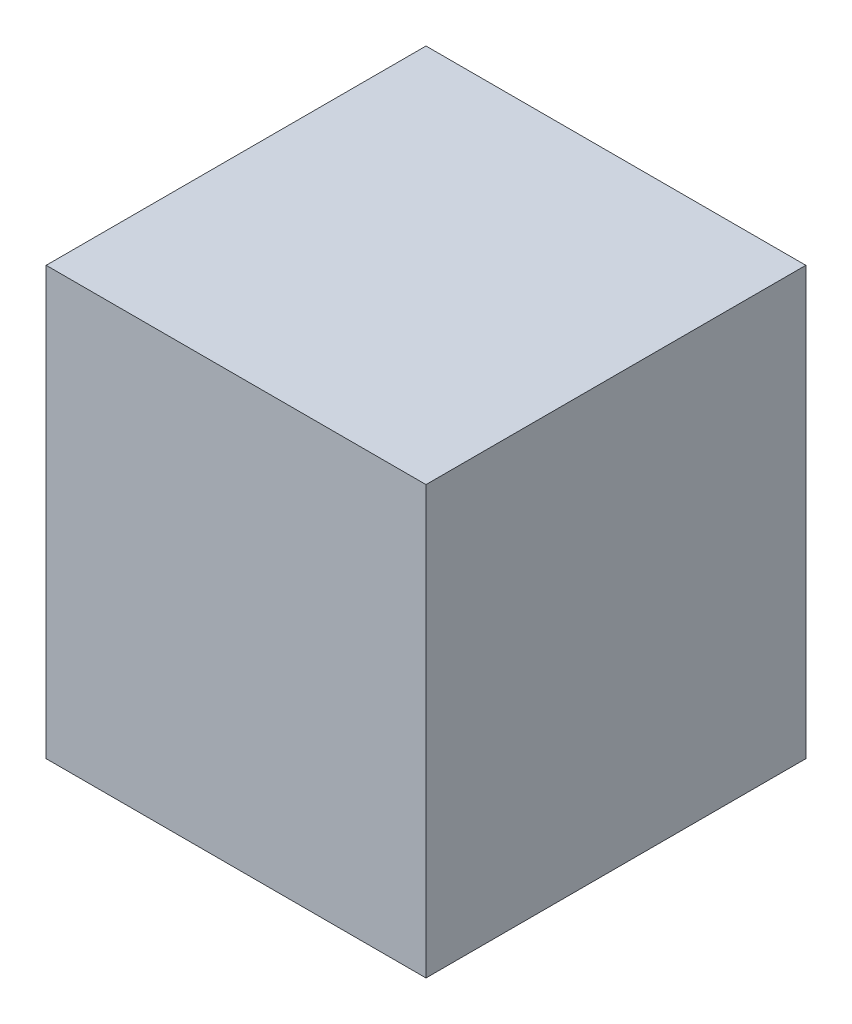
ISO-10303-21;
HEADER;
FILE_DESCRIPTION(('STEP AP214'),'2;1');
FILE_NAME('part.step','',(''),(''),'','','');
FILE_SCHEMA(('AUTOMOTIVE_DESIGN { 1 0 10303 214 1 1 1 1 }'));
ENDSEC;
DATA;
#1=APPLICATION_CONTEXT('core data for automotive mechanical design processes');
#2=APPLICATION_PROTOCOL_DEFINITION('international standard','automotive_design',2000,#1);
#3=PRODUCT_CONTEXT('',#1,'mechanical');
#4=PRODUCT('Part','Part','',(#3));
#5=PRODUCT_RELATED_PRODUCT_CATEGORY('part','',(#4));
#6=PRODUCT_DEFINITION_FORMATION('','',#4);
#7=PRODUCT_DEFINITION_CONTEXT('part definition',#1,'design');
#8=PRODUCT_DEFINITION('design','',#6,#7);
#9=PRODUCT_DEFINITION_SHAPE('','',#8);
#10=(LENGTH_UNIT() NAMED_UNIT(*) SI_UNIT(.MILLI.,.METRE.));
#11=(NAMED_UNIT(*) PLANE_ANGLE_UNIT() SI_UNIT($,.RADIAN.));
#12=(NAMED_UNIT(*) SI_UNIT($,.STERADIAN.) SOLID_ANGLE_UNIT());
#13=UNCERTAINTY_MEASURE_WITH_UNIT(LENGTH_MEASURE(1.E-05),#10,'distance_accuracy_value','');
#14=(GEOMETRIC_REPRESENTATION_CONTEXT(3) GLOBAL_UNCERTAINTY_ASSIGNED_CONTEXT((#13)) GLOBAL_UNIT_ASSIGNED_CONTEXT((#10,
#11,#12)) REPRESENTATION_CONTEXT('',''));
#15=CARTESIAN_POINT('',(0.,0.,0.));
#16=DIRECTION('',(0.,0.,1.));
#17=DIRECTION('',(1.,0.,0.));
#18=AXIS2_PLACEMENT_3D('',#15,#16,#17);
#19=CARTESIAN_POINT('',(-0.3999992,-0.4499991,0.80000094));
#20=DIRECTION('',(0.,0.,-1.));
#21=DIRECTION('',(-1.,0.,0.));
#22=AXIS2_PLACEMENT_3D('',#19,#20,#21);
#23=PLANE('',#22);
#24=DIRECTION('',(0.,1.,0.));
#25=VECTOR('',#24,1.);
#26=CARTESIAN_POINT('',(0.40000174,-0.4499991,0.80000094));
#27=LINE('',#26,#25);
#28=CARTESIAN_POINT('',(0.40000174,-0.4499991,0.80000094));
#29=VERTEX_POINT('',#28);
#30=CARTESIAN_POINT('',(0.40000174,0.45000164,0.80000094));
#31=VERTEX_POINT('',#30);
#32=EDGE_CURVE('E55',#29,#31,#27,.T.);
#33=ORIENTED_EDGE('',*,*,#32,.T.);
#34=DIRECTION('',(1.,0.,0.));
#35=VECTOR('',#34,1.);
#36=CARTESIAN_POINT('',(0.40000174,0.45000164,0.80000094));
#37=LINE('',#36,#35);
#38=CARTESIAN_POINT('',(-0.3999992,0.45000164,0.80000094));
#39=VERTEX_POINT('',#38);
#40=EDGE_CURVE('E57',#31,#39,#37,.F.);
#41=ORIENTED_EDGE('',*,*,#40,.T.);
#42=DIRECTION('',(0.,1.,0.));
#43=VECTOR('',#42,1.);
#44=CARTESIAN_POINT('',(-0.3999992,0.45000164,0.80000094));
#45=LINE('',#44,#43);
#46=CARTESIAN_POINT('',(-0.3999992,-0.4499991,0.80000094));
#47=VERTEX_POINT('',#46);
#48=EDGE_CURVE('E20',#39,#47,#45,.F.);
#49=ORIENTED_EDGE('',*,*,#48,.T.);
#50=DIRECTION('',(1.,0.,0.));
#51=VECTOR('',#50,1.);
#52=CARTESIAN_POINT('',(-0.3999992,-0.4499991,0.80000094));
#53=LINE('',#52,#51);
#54=EDGE_CURVE('E80',#47,#29,#53,.T.);
#55=ORIENTED_EDGE('',*,*,#54,.T.);
#56=EDGE_LOOP('',(#33,#41,#49,#55));
#57=FACE_BOUND('',#56,.T.);
#58=ADVANCED_FACE('F17',(#57),#23,.F.);
#59=CARTESIAN_POINT('',(-0.3999992,0.45000164,0.));
#60=DIRECTION('',(1.,0.,0.));
#61=DIRECTION('',(0.,0.,-1.));
#62=AXIS2_PLACEMENT_3D('',#59,#60,#61);
#63=PLANE('',#62);
#64=DIRECTION('',(0.,0.,1.));
#65=VECTOR('',#64,1.);
#66=CARTESIAN_POINT('',(-0.3999992,-0.4499991,0.));
#67=LINE('',#66,#65);
#68=CARTESIAN_POINT('',(-0.3999992,-0.4499991,0.));
#69=VERTEX_POINT('',#68);
#70=EDGE_CURVE('E68',#69,#47,#67,.T.);
#71=ORIENTED_EDGE('',*,*,#70,.T.);
#72=ORIENTED_EDGE('',*,*,#48,.F.);
#73=DIRECTION('',(0.,0.,-1.));
#74=VECTOR('',#73,1.);
#75=CARTESIAN_POINT('',(-0.3999992,0.45000164,0.));
#76=LINE('',#75,#74);
#77=CARTESIAN_POINT('',(-0.3999992,0.45000164,0.));
#78=VERTEX_POINT('',#77);
#79=EDGE_CURVE('E63',#39,#78,#76,.T.);
#80=ORIENTED_EDGE('',*,*,#79,.T.);
#81=DIRECTION('',(0.,1.,0.));
#82=VECTOR('',#81,1.);
#83=CARTESIAN_POINT('',(-0.3999992,-0.4499991,0.));
#84=LINE('',#83,#82);
#85=EDGE_CURVE('E83',#69,#78,#84,.T.);
#86=ORIENTED_EDGE('',*,*,#85,.F.);
#87=EDGE_LOOP('',(#71,#72,#80,#86));
#88=FACE_BOUND('',#87,.T.);
#89=ADVANCED_FACE('F65',(#88),#63,.F.);
#90=CARTESIAN_POINT('',(0.40000174,0.45000164,0.));
#91=DIRECTION('',(0.,-1.,0.));
#92=DIRECTION('',(0.,0.,-1.));
#93=AXIS2_PLACEMENT_3D('',#90,#91,#92);
#94=PLANE('',#93);
#95=ORIENTED_EDGE('',*,*,#79,.F.);
#96=ORIENTED_EDGE('',*,*,#40,.F.);
#97=DIRECTION('',(0.,0.,1.));
#98=VECTOR('',#97,1.);
#99=CARTESIAN_POINT('',(0.40000174,0.45000164,0.));
#100=LINE('',#99,#98);
#101=CARTESIAN_POINT('',(0.40000174,0.45000164,0.));
#102=VERTEX_POINT('',#101);
#103=EDGE_CURVE('E75',#31,#102,#100,.F.);
#104=ORIENTED_EDGE('',*,*,#103,.T.);
#105=DIRECTION('',(-1.,0.,0.));
#106=VECTOR('',#105,1.);
#107=CARTESIAN_POINT('',(-0.3999992,0.45000164,0.));
#108=LINE('',#107,#106);
#109=EDGE_CURVE('E72',#78,#102,#108,.F.);
#110=ORIENTED_EDGE('',*,*,#109,.F.);
#111=EDGE_LOOP('',(#95,#96,#104,#110));
#112=FACE_BOUND('',#111,.T.);
#113=ADVANCED_FACE('F70',(#112),#94,.F.);
#114=CARTESIAN_POINT('',(0.40000174,-0.4499991,0.));
#115=DIRECTION('',(-1.,0.,0.));
#116=DIRECTION('',(0.,0.,1.));
#117=AXIS2_PLACEMENT_3D('',#114,#115,#116);
#118=PLANE('',#117);
#119=ORIENTED_EDGE('',*,*,#103,.F.);
#120=ORIENTED_EDGE('',*,*,#32,.F.);
#121=DIRECTION('',(0.,0.,1.));
#122=VECTOR('',#121,1.);
#123=CARTESIAN_POINT('',(0.40000174,-0.4499991,0.));
#124=LINE('',#123,#122);
#125=CARTESIAN_POINT('',(0.40000174,-0.4499991,0.));
#126=VERTEX_POINT('',#125);
#127=EDGE_CURVE('E35',#29,#126,#124,.F.);
#128=ORIENTED_EDGE('',*,*,#127,.T.);
#129=DIRECTION('',(0.,1.,0.));
#130=VECTOR('',#129,1.);
#131=CARTESIAN_POINT('',(0.40000174,-0.4499991,0.));
#132=LINE('',#131,#130);
#133=EDGE_CURVE('E26',#102,#126,#132,.F.);
#134=ORIENTED_EDGE('',*,*,#133,.F.);
#135=EDGE_LOOP('',(#119,#120,#128,#134));
#136=FACE_BOUND('',#135,.T.);
#137=ADVANCED_FACE('F89',(#136),#118,.F.);
#138=CARTESIAN_POINT('',(-0.3999992,-0.4499991,0.));
#139=DIRECTION('',(0.,1.,0.));
#140=DIRECTION('',(0.,0.,1.));
#141=AXIS2_PLACEMENT_3D('',#138,#139,#140);
#142=PLANE('',#141);
#143=ORIENTED_EDGE('',*,*,#127,.F.);
#144=ORIENTED_EDGE('',*,*,#54,.F.);
#145=ORIENTED_EDGE('',*,*,#70,.F.);
#146=DIRECTION('',(-1.,0.,0.));
#147=VECTOR('',#146,1.);
#148=CARTESIAN_POINT('',(-0.3999992,-0.4499991,0.));
#149=LINE('',#148,#147);
#150=EDGE_CURVE('E11',#126,#69,#149,.T.);
#151=ORIENTED_EDGE('',*,*,#150,.F.);
#152=EDGE_LOOP('',(#143,#144,#145,#151));
#153=FACE_BOUND('',#152,.T.);
#154=ADVANCED_FACE('F91',(#153),#142,.F.);
#155=CARTESIAN_POINT('',(-0.3999992,-0.4499991,0.));
#156=DIRECTION('',(0.,0.,-1.));
#157=DIRECTION('',(-1.,0.,0.));
#158=AXIS2_PLACEMENT_3D('',#155,#156,#157);
#159=PLANE('',#158);
#160=ORIENTED_EDGE('',*,*,#133,.T.);
#161=ORIENTED_EDGE('',*,*,#150,.T.);
#162=ORIENTED_EDGE('',*,*,#85,.T.);
#163=ORIENTED_EDGE('',*,*,#109,.T.);
#164=EDGE_LOOP('',(#160,#161,#162,#163));
#165=FACE_BOUND('',#164,.T.);
#166=ADVANCED_FACE('F88',(#165),#159,.T.);
#167=CLOSED_SHELL('',(#58,#89,#113,#137,#154,#166));
#168=MANIFOLD_SOLID_BREP('B1',#167);
#169=ADVANCED_BREP_SHAPE_REPRESENTATION('',(#18,#168),#14);
#170=SHAPE_DEFINITION_REPRESENTATION(#9,#169);
ENDSEC;
END-ISO-10303-21;
